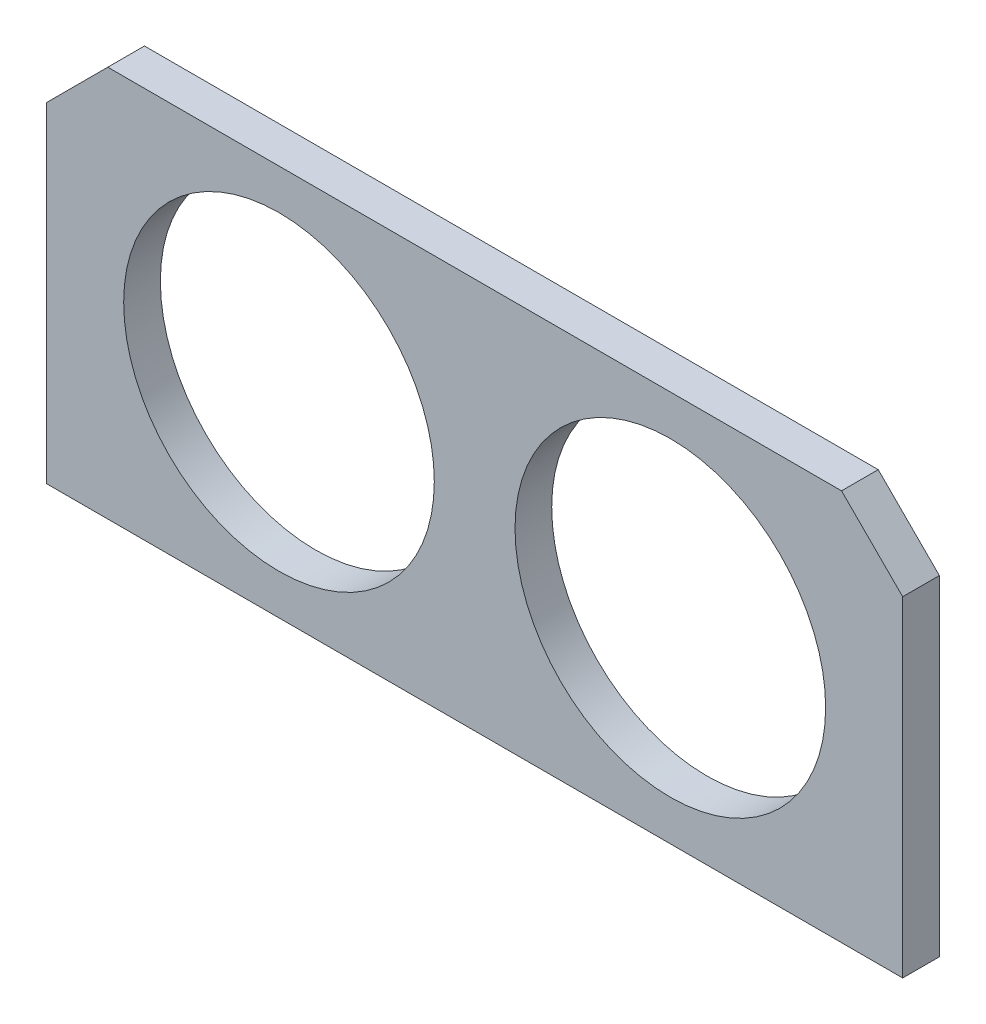
ISO-10303-21;
HEADER;
FILE_DESCRIPTION(('STEP AP214'),'2;1');
FILE_NAME('part.step','',(''),(''),'','','');
FILE_SCHEMA(('AUTOMOTIVE_DESIGN { 1 0 10303 214 1 1 1 1 }'));
ENDSEC;
DATA;
#1=APPLICATION_CONTEXT('core data for automotive mechanical design processes');
#2=APPLICATION_PROTOCOL_DEFINITION('international standard','automotive_design',2000,#1);
#3=PRODUCT_CONTEXT('',#1,'mechanical');
#4=PRODUCT('Part','Part','',(#3));
#5=PRODUCT_RELATED_PRODUCT_CATEGORY('part','',(#4));
#6=PRODUCT_DEFINITION_FORMATION('','',#4);
#7=PRODUCT_DEFINITION_CONTEXT('part definition',#1,'design');
#8=PRODUCT_DEFINITION('design','',#6,#7);
#9=PRODUCT_DEFINITION_SHAPE('','',#8);
#10=(LENGTH_UNIT() NAMED_UNIT(*) SI_UNIT(.MILLI.,.METRE.));
#11=(NAMED_UNIT(*) PLANE_ANGLE_UNIT() SI_UNIT($,.RADIAN.));
#12=(NAMED_UNIT(*) SI_UNIT($,.STERADIAN.) SOLID_ANGLE_UNIT());
#13=UNCERTAINTY_MEASURE_WITH_UNIT(LENGTH_MEASURE(1.E-05),#10,'distance_accuracy_value','');
#14=(GEOMETRIC_REPRESENTATION_CONTEXT(3) GLOBAL_UNCERTAINTY_ASSIGNED_CONTEXT((#13)) GLOBAL_UNIT_ASSIGNED_CONTEXT((#10,
#11,#12)) REPRESENTATION_CONTEXT('',''));
#15=CARTESIAN_POINT('',(0.,0.,0.));
#16=DIRECTION('',(0.,0.,1.));
#17=DIRECTION('',(1.,0.,0.));
#18=AXIS2_PLACEMENT_3D('',#15,#16,#17);
#19=CARTESIAN_POINT('',(0.,0.,3.));
#20=DIRECTION('',(0.,0.,-1.));
#21=DIRECTION('',(-1.,0.,0.));
#22=AXIS2_PLACEMENT_3D('',#19,#20,#21);
#23=PLANE('',#22);
#24=DIRECTION('',(0.,-1.,0.));
#25=VECTOR('',#24,1.);
#26=CARTESIAN_POINT('',(-8.69800271418188,40.8446303155016,3.));
#27=LINE('',#26,#25);
#28=CARTESIAN_POINT('',(-8.69800271418188,35.8446303155015,3.));
#29=VERTEX_POINT('',#28);
#30=CARTESIAN_POINT('',(-8.69800271418188,8.84463031550155,3.));
#31=VERTEX_POINT('',#30);
#32=EDGE_CURVE('E156',#29,#31,#27,.T.);
#33=ORIENTED_EDGE('',*,*,#32,.F.);
#34=DIRECTION('',(0.707106781186546,-0.707106781186549,0.));
#35=VECTOR('',#34,1.);
#36=CARTESIAN_POINT('',(-13.6980027141819,40.8446303155016,3.));
#37=LINE('',#36,#35);
#38=CARTESIAN_POINT('',(-13.6980027141819,40.8446303155016,3.));
#39=VERTEX_POINT('',#38);
#40=EDGE_CURVE('E88',#29,#39,#37,.F.);
#41=ORIENTED_EDGE('',*,*,#40,.T.);
#42=DIRECTION('',(-1.,0.,0.));
#43=VECTOR('',#42,1.);
#44=CARTESIAN_POINT('',(-59.6980027141819,40.8446303155016,3.));
#45=LINE('',#44,#43);
#46=CARTESIAN_POINT('',(-73.6980027141819,40.8446303155015,3.));
#47=VERTEX_POINT('',#46);
#48=EDGE_CURVE('E141',#39,#47,#45,.T.);
#49=ORIENTED_EDGE('',*,*,#48,.T.);
#50=DIRECTION('',(-0.707106781186549,-0.707106781186546,0.));
#51=VECTOR('',#50,1.);
#52=CARTESIAN_POINT('',(-78.6980027141819,35.8446303155016,3.));
#53=LINE('',#52,#51);
#54=CARTESIAN_POINT('',(-78.6980027141819,35.8446303155016,3.));
#55=VERTEX_POINT('',#54);
#56=EDGE_CURVE('E95',#47,#55,#53,.T.);
#57=ORIENTED_EDGE('',*,*,#56,.T.);
#58=DIRECTION('',(0.,1.,0.));
#59=VECTOR('',#58,1.);
#60=CARTESIAN_POINT('',(-78.6980027141819,24.8446303155015,3.));
#61=LINE('',#60,#59);
#62=CARTESIAN_POINT('',(-78.6980027141819,8.84463031550155,3.));
#63=VERTEX_POINT('',#62);
#64=EDGE_CURVE('E133',#63,#55,#61,.T.);
#65=ORIENTED_EDGE('',*,*,#64,.F.);
#66=DIRECTION('',(-1.,0.,0.));
#67=VECTOR('',#66,1.);
#68=CARTESIAN_POINT('',(-59.6980027141819,8.84463031550155,3.));
#69=LINE('',#68,#67);
#70=EDGE_CURVE('E137',#31,#63,#69,.T.);
#71=ORIENTED_EDGE('',*,*,#70,.F.);
#72=EDGE_LOOP('',(#33,#41,#49,#57,#65,#71));
#73=FACE_BOUND('',#72,.T.);
#74=CARTESIAN_POINT('',(-59.6980027141819,24.8446303155016,3.));
#75=DIRECTION('',(0.,0.,1.));
#76=DIRECTION('',(1.,0.,0.));
#77=AXIS2_PLACEMENT_3D('',#74,#75,#76);
#78=CIRCLE('',#77,12.7);
#79=CARTESIAN_POINT('',(-46.9980027141819,24.8446303155016,3.));
#80=VERTEX_POINT('',#79);
#81=EDGE_CURVE('E163',#80,#80,#78,.T.);
#82=ORIENTED_EDGE('',*,*,#81,.F.);
#83=EDGE_LOOP('',(#82));
#84=FACE_BOUND('',#83,.T.);
#85=CARTESIAN_POINT('',(-27.6980027141819,24.8446303155016,3.));
#86=DIRECTION('',(0.,0.,1.));
#87=DIRECTION('',(1.,0.,0.));
#88=AXIS2_PLACEMENT_3D('',#85,#86,#87);
#89=CIRCLE('',#88,12.7);
#90=CARTESIAN_POINT('',(-14.9980027141819,24.8446303155016,3.));
#91=VERTEX_POINT('',#90);
#92=EDGE_CURVE('E295',#91,#91,#89,.T.);
#93=ORIENTED_EDGE('',*,*,#92,.F.);
#94=EDGE_LOOP('',(#93));
#95=FACE_BOUND('',#94,.T.);
#96=ADVANCED_FACE('F80',(#73,#84,#95),#23,.F.);
#97=CARTESIAN_POINT('',(0.,0.,0.));
#98=DIRECTION('',(0.,0.,-1.));
#99=DIRECTION('',(-1.,0.,0.));
#100=AXIS2_PLACEMENT_3D('',#97,#98,#99);
#101=PLANE('',#100);
#102=CARTESIAN_POINT('',(-59.6980027141819,24.8446303155016,0.));
#103=DIRECTION('',(0.,0.,1.));
#104=DIRECTION('',(1.,0.,0.));
#105=AXIS2_PLACEMENT_3D('',#102,#103,#104);
#106=CIRCLE('',#105,12.7);
#107=CARTESIAN_POINT('',(-46.9980027141819,24.8446303155016,0.));
#108=VERTEX_POINT('',#107);
#109=EDGE_CURVE('E300',#108,#108,#106,.T.);
#110=ORIENTED_EDGE('',*,*,#109,.T.);
#111=EDGE_LOOP('',(#110));
#112=FACE_BOUND('',#111,.T.);
#113=DIRECTION('',(1.,0.,0.));
#114=VECTOR('',#113,1.);
#115=CARTESIAN_POINT('',(-59.6980027141819,40.8446303155016,0.));
#116=LINE('',#115,#114);
#117=CARTESIAN_POINT('',(-73.6980027141818,40.8446303155016,0.));
#118=VERTEX_POINT('',#117);
#119=CARTESIAN_POINT('',(-13.6980027141819,40.8446303155016,0.));
#120=VERTEX_POINT('',#119);
#121=EDGE_CURVE('E167',#118,#120,#116,.T.);
#122=ORIENTED_EDGE('',*,*,#121,.T.);
#123=DIRECTION('',(-0.707106781186546,0.707106781186549,0.));
#124=VECTOR('',#123,1.);
#125=CARTESIAN_POINT('',(13.5733138006598,13.5733138006598,0.));
#126=LINE('',#125,#124);
#127=CARTESIAN_POINT('',(-8.69800271418188,35.8446303155015,0.));
#128=VERTEX_POINT('',#127);
#129=EDGE_CURVE('E177',#120,#128,#126,.F.);
#130=ORIENTED_EDGE('',*,*,#129,.T.);
#131=DIRECTION('',(0.,-1.,0.));
#132=VECTOR('',#131,1.);
#133=CARTESIAN_POINT('',(-8.69800271418188,40.8446303155016,0.));
#134=LINE('',#133,#132);
#135=CARTESIAN_POINT('',(-8.69800271418188,8.84463031550155,0.));
#136=VERTEX_POINT('',#135);
#137=EDGE_CURVE('E165',#128,#136,#134,.T.);
#138=ORIENTED_EDGE('',*,*,#137,.T.);
#139=DIRECTION('',(1.,0.,0.));
#140=VECTOR('',#139,1.);
#141=CARTESIAN_POINT('',(-59.6980027141819,8.84463031550155,0.));
#142=LINE('',#141,#140);
#143=CARTESIAN_POINT('',(-78.6980027141819,8.84463031550155,0.));
#144=VERTEX_POINT('',#143);
#145=EDGE_CURVE('E162',#144,#136,#142,.T.);
#146=ORIENTED_EDGE('',*,*,#145,.F.);
#147=DIRECTION('',(0.,-1.,0.));
#148=VECTOR('',#147,1.);
#149=CARTESIAN_POINT('',(-78.6980027141819,24.8446303155015,0.));
#150=LINE('',#149,#148);
#151=CARTESIAN_POINT('',(-78.6980027141819,35.8446303155016,0.));
#152=VERTEX_POINT('',#151);
#153=EDGE_CURVE('E147',#152,#144,#150,.T.);
#154=ORIENTED_EDGE('',*,*,#153,.F.);
#155=DIRECTION('',(0.707106781186549,0.707106781186546,0.));
#156=VECTOR('',#155,1.);
#157=CARTESIAN_POINT('',(-57.2713165148415,57.2713165148418,0.));
#158=LINE('',#157,#156);
#159=EDGE_CURVE('E175',#152,#118,#158,.T.);
#160=ORIENTED_EDGE('',*,*,#159,.T.);
#161=EDGE_LOOP('',(#122,#130,#138,#146,#154,#160));
#162=FACE_BOUND('',#161,.T.);
#163=CARTESIAN_POINT('',(-27.6980027141819,24.8446303155016,0.));
#164=DIRECTION('',(0.,0.,1.));
#165=DIRECTION('',(1.,0.,0.));
#166=AXIS2_PLACEMENT_3D('',#163,#164,#165);
#167=CIRCLE('',#166,12.7);
#168=CARTESIAN_POINT('',(-14.9980027141819,24.8446303155016,0.));
#169=VERTEX_POINT('',#168);
#170=EDGE_CURVE('E298',#169,#169,#167,.T.);
#171=ORIENTED_EDGE('',*,*,#170,.T.);
#172=EDGE_LOOP('',(#171));
#173=FACE_BOUND('',#172,.T.);
#174=ADVANCED_FACE('F190',(#112,#162,#173),#101,.T.);
#175=CARTESIAN_POINT('',(-78.6980027141819,24.8446303155015,3.));
#176=DIRECTION('',(1.,0.,0.));
#177=DIRECTION('',(0.,0.,-1.));
#178=AXIS2_PLACEMENT_3D('',#175,#176,#177);
#179=PLANE('',#178);
#180=ORIENTED_EDGE('',*,*,#64,.T.);
#181=DIRECTION('',(0.,0.,-1.));
#182=VECTOR('',#181,1.);
#183=CARTESIAN_POINT('',(-78.6980027141819,35.8446303155016,0.));
#184=LINE('',#183,#182);
#185=EDGE_CURVE('E12',#55,#152,#184,.T.);
#186=ORIENTED_EDGE('',*,*,#185,.T.);
#187=ORIENTED_EDGE('',*,*,#153,.T.);
#188=DIRECTION('',(0.,0.,-1.));
#189=VECTOR('',#188,1.);
#190=CARTESIAN_POINT('',(-78.6980027141819,8.84463031550155,3.));
#191=LINE('',#190,#189);
#192=EDGE_CURVE('E144',#63,#144,#191,.T.);
#193=ORIENTED_EDGE('',*,*,#192,.F.);
#194=EDGE_LOOP('',(#180,#186,#187,#193));
#195=FACE_BOUND('',#194,.T.);
#196=ADVANCED_FACE('F145',(#195),#179,.F.);
#197=CARTESIAN_POINT('',(-59.6980027141819,8.84463031550155,3.));
#198=DIRECTION('',(0.,1.,0.));
#199=DIRECTION('',(-1.,0.,0.));
#200=AXIS2_PLACEMENT_3D('',#197,#198,#199);
#201=PLANE('',#200);
#202=ORIENTED_EDGE('',*,*,#145,.T.);
#203=DIRECTION('',(0.,0.,-1.));
#204=VECTOR('',#203,1.);
#205=CARTESIAN_POINT('',(-8.69800271418188,8.84463031550155,3.));
#206=LINE('',#205,#204);
#207=EDGE_CURVE('E152',#31,#136,#206,.T.);
#208=ORIENTED_EDGE('',*,*,#207,.F.);
#209=ORIENTED_EDGE('',*,*,#70,.T.);
#210=ORIENTED_EDGE('',*,*,#192,.T.);
#211=EDGE_LOOP('',(#202,#208,#209,#210));
#212=FACE_BOUND('',#211,.T.);
#213=ADVANCED_FACE('F154',(#212),#201,.F.);
#214=CARTESIAN_POINT('',(-8.69800271418188,40.8446303155016,3.));
#215=DIRECTION('',(1.,0.,0.));
#216=DIRECTION('',(0.,1.,0.));
#217=AXIS2_PLACEMENT_3D('',#214,#215,#216);
#218=PLANE('',#217);
#219=ORIENTED_EDGE('',*,*,#137,.F.);
#220=DIRECTION('',(0.,0.,1.));
#221=VECTOR('',#220,1.);
#222=CARTESIAN_POINT('',(-8.69800271418188,35.8446303155015,3.));
#223=LINE('',#222,#221);
#224=EDGE_CURVE('E103',#128,#29,#223,.T.);
#225=ORIENTED_EDGE('',*,*,#224,.T.);
#226=ORIENTED_EDGE('',*,*,#32,.T.);
#227=ORIENTED_EDGE('',*,*,#207,.T.);
#228=EDGE_LOOP('',(#219,#225,#226,#227));
#229=FACE_BOUND('',#228,.T.);
#230=ADVANCED_FACE('F192',(#229),#218,.T.);
#231=CARTESIAN_POINT('',(-59.6980027141819,40.8446303155016,3.));
#232=DIRECTION('',(0.,1.,0.));
#233=DIRECTION('',(0.,0.,1.));
#234=AXIS2_PLACEMENT_3D('',#231,#232,#233);
#235=PLANE('',#234);
#236=ORIENTED_EDGE('',*,*,#48,.F.);
#237=DIRECTION('',(0.,0.,-1.));
#238=VECTOR('',#237,1.);
#239=CARTESIAN_POINT('',(-13.6980027141819,40.8446303155016,3.));
#240=LINE('',#239,#238);
#241=EDGE_CURVE('E172',#39,#120,#240,.T.);
#242=ORIENTED_EDGE('',*,*,#241,.T.);
#243=ORIENTED_EDGE('',*,*,#121,.F.);
#244=DIRECTION('',(0.,0.,1.));
#245=VECTOR('',#244,1.);
#246=CARTESIAN_POINT('',(-73.6980027141818,40.8446303155016,3.));
#247=LINE('',#246,#245);
#248=EDGE_CURVE('E151',#118,#47,#247,.T.);
#249=ORIENTED_EDGE('',*,*,#248,.T.);
#250=EDGE_LOOP('',(#236,#242,#243,#249));
#251=FACE_BOUND('',#250,.T.);
#252=ADVANCED_FACE('F185',(#251),#235,.T.);
#253=CARTESIAN_POINT('',(-59.6980027141819,24.8446303155016,3.));
#254=DIRECTION('',(0.,0.,-1.));
#255=DIRECTION('',(-1.,0.,0.));
#256=AXIS2_PLACEMENT_3D('',#253,#254,#255);
#257=CYLINDRICAL_SURFACE('',#256,12.7);
#258=ORIENTED_EDGE('',*,*,#81,.T.);
#259=EDGE_LOOP('',(#258));
#260=FACE_BOUND('',#259,.T.);
#261=ORIENTED_EDGE('',*,*,#109,.F.);
#262=EDGE_LOOP('',(#261));
#263=FACE_BOUND('',#262,.T.);
#264=ADVANCED_FACE('F207',(#260,#263),#257,.F.);
#265=CARTESIAN_POINT('',(-27.6980027141819,24.8446303155016,3.));
#266=DIRECTION('',(0.,0.,-1.));
#267=DIRECTION('',(-1.,0.,0.));
#268=AXIS2_PLACEMENT_3D('',#265,#266,#267);
#269=CYLINDRICAL_SURFACE('',#268,12.7);
#270=ORIENTED_EDGE('',*,*,#92,.T.);
#271=EDGE_LOOP('',(#270));
#272=FACE_BOUND('',#271,.T.);
#273=ORIENTED_EDGE('',*,*,#170,.F.);
#274=EDGE_LOOP('',(#273));
#275=FACE_BOUND('',#274,.T.);
#276=ADVANCED_FACE('F198',(#272,#275),#269,.F.);
#277=CARTESIAN_POINT('',(-13.6980027141819,40.8446303155016,3.));
#278=DIRECTION('',(-0.707106781186549,-0.707106781186546,0.));
#279=DIRECTION('',(0.,0.,-1.));
#280=AXIS2_PLACEMENT_3D('',#277,#278,#279);
#281=PLANE('',#280);
#282=ORIENTED_EDGE('',*,*,#40,.F.);
#283=ORIENTED_EDGE('',*,*,#224,.F.);
#284=ORIENTED_EDGE('',*,*,#129,.F.);
#285=ORIENTED_EDGE('',*,*,#241,.F.);
#286=EDGE_LOOP('',(#282,#283,#284,#285));
#287=FACE_BOUND('',#286,.T.);
#288=ADVANCED_FACE('F188',(#287),#281,.F.);
#289=CARTESIAN_POINT('',(-78.6980027141819,35.8446303155016,3.));
#290=DIRECTION('',(-0.707106781186545,0.707106781186549,0.));
#291=DIRECTION('',(0.,0.,1.));
#292=AXIS2_PLACEMENT_3D('',#289,#290,#291);
#293=PLANE('',#292);
#294=ORIENTED_EDGE('',*,*,#56,.F.);
#295=ORIENTED_EDGE('',*,*,#248,.F.);
#296=ORIENTED_EDGE('',*,*,#159,.F.);
#297=ORIENTED_EDGE('',*,*,#185,.F.);
#298=EDGE_LOOP('',(#294,#295,#296,#297));
#299=FACE_BOUND('',#298,.T.);
#300=ADVANCED_FACE('F82',(#299),#293,.T.);
#301=CLOSED_SHELL('',(#96,#174,#196,#213,#230,#252,#264,#276,#288,#300));
#302=MANIFOLD_SOLID_BREP('B2',#301);
#303=ADVANCED_BREP_SHAPE_REPRESENTATION('',(#18,#302),#14);
#304=SHAPE_DEFINITION_REPRESENTATION(#9,#303);
ENDSEC;
END-ISO-10303-21;
